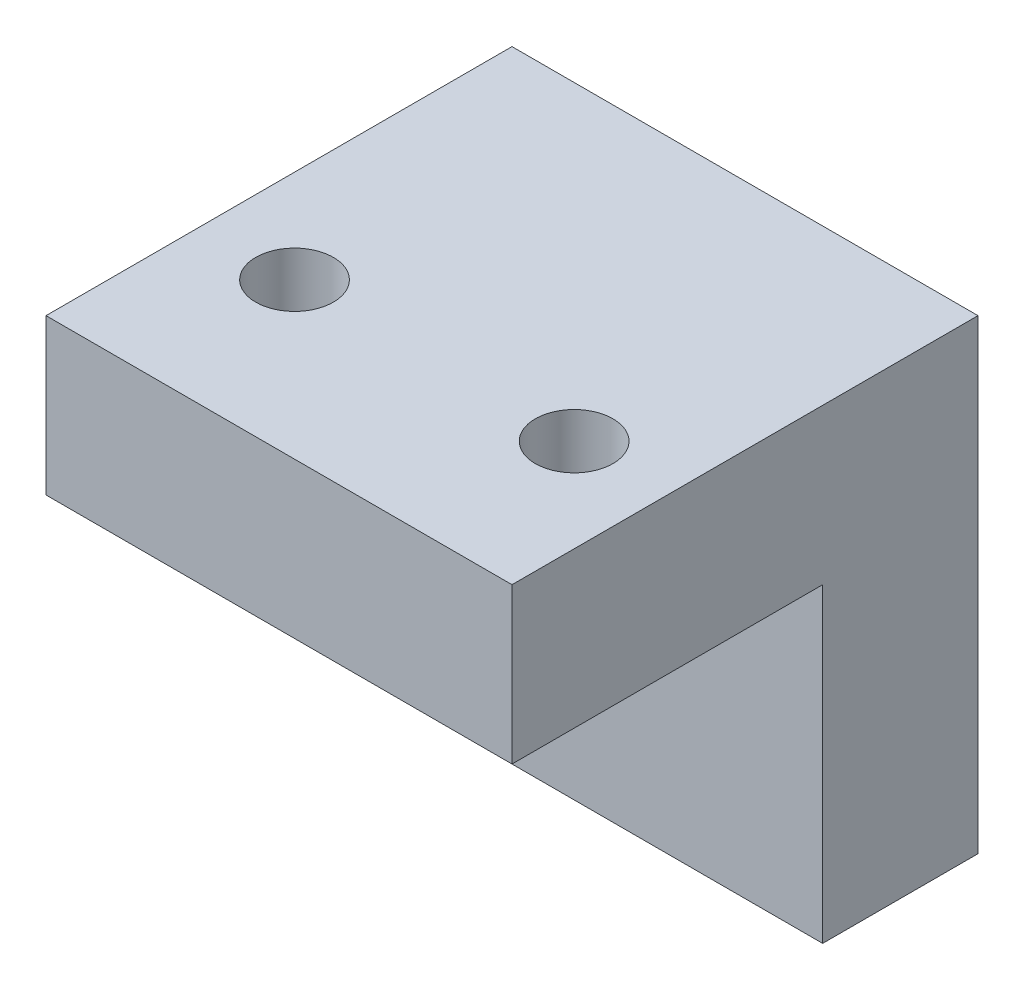
ISO-10303-21;
HEADER;
FILE_DESCRIPTION(('STEP AP214'),'2;1');
FILE_NAME('part.step','',(''),(''),'','','');
FILE_SCHEMA(('AUTOMOTIVE_DESIGN { 1 0 10303 214 1 1 1 1 }'));
ENDSEC;
DATA;
#1=APPLICATION_CONTEXT('core data for automotive mechanical design processes');
#2=APPLICATION_PROTOCOL_DEFINITION('international standard','automotive_design',2000,#1);
#3=PRODUCT_CONTEXT('',#1,'mechanical');
#4=PRODUCT('Part','Part','',(#3));
#5=PRODUCT_RELATED_PRODUCT_CATEGORY('part','',(#4));
#6=PRODUCT_DEFINITION_FORMATION('','',#4);
#7=PRODUCT_DEFINITION_CONTEXT('part definition',#1,'design');
#8=PRODUCT_DEFINITION('design','',#6,#7);
#9=PRODUCT_DEFINITION_SHAPE('','',#8);
#10=(LENGTH_UNIT() NAMED_UNIT(*) SI_UNIT(.MILLI.,.METRE.));
#11=(NAMED_UNIT(*) PLANE_ANGLE_UNIT() SI_UNIT($,.RADIAN.));
#12=(NAMED_UNIT(*) SI_UNIT($,.STERADIAN.) SOLID_ANGLE_UNIT());
#13=UNCERTAINTY_MEASURE_WITH_UNIT(LENGTH_MEASURE(1.E-05),#10,'distance_accuracy_value','');
#14=(GEOMETRIC_REPRESENTATION_CONTEXT(3) GLOBAL_UNCERTAINTY_ASSIGNED_CONTEXT((#13)) GLOBAL_UNIT_ASSIGNED_CONTEXT((#10,
#11,#12)) REPRESENTATION_CONTEXT('',''));
#15=CARTESIAN_POINT('',(0.,0.,0.));
#16=DIRECTION('',(0.,0.,1.));
#17=DIRECTION('',(1.,0.,0.));
#18=AXIS2_PLACEMENT_3D('',#15,#16,#17);
#19=CARTESIAN_POINT('',(0.,10.,0.));
#20=DIRECTION('',(1.,0.,0.));
#21=DIRECTION('',(0.,0.,-1.));
#22=AXIS2_PLACEMENT_3D('',#19,#20,#21);
#23=PLANE('',#22);
#24=DIRECTION('',(0.,0.,1.));
#25=VECTOR('',#24,1.);
#26=CARTESIAN_POINT('',(0.,0.,0.));
#27=LINE('',#26,#25);
#28=CARTESIAN_POINT('',(0.,0.,-5.));
#29=VERTEX_POINT('',#28);
#30=CARTESIAN_POINT('',(0.,0.,0.));
#31=VERTEX_POINT('',#30);
#32=EDGE_CURVE('E93',#29,#31,#27,.T.);
#33=ORIENTED_EDGE('',*,*,#32,.T.);
#34=DIRECTION('',(0.,-1.,0.));
#35=VECTOR('',#34,1.);
#36=CARTESIAN_POINT('',(0.,10.,0.));
#37=LINE('',#36,#35);
#38=CARTESIAN_POINT('',(0.,10.,0.));
#39=VERTEX_POINT('',#38);
#40=EDGE_CURVE('E11',#39,#31,#37,.T.);
#41=ORIENTED_EDGE('',*,*,#40,.F.);
#42=DIRECTION('',(0.,0.,1.));
#43=VECTOR('',#42,1.);
#44=CARTESIAN_POINT('',(0.,10.,-5.));
#45=LINE('',#44,#43);
#46=CARTESIAN_POINT('',(0.,10.,10.));
#47=VERTEX_POINT('',#46);
#48=EDGE_CURVE('E119',#39,#47,#45,.T.);
#49=ORIENTED_EDGE('',*,*,#48,.T.);
#50=DIRECTION('',(0.,-1.,0.));
#51=VECTOR('',#50,1.);
#52=CARTESIAN_POINT('',(0.,15.,10.));
#53=LINE('',#52,#51);
#54=CARTESIAN_POINT('',(0.,15.,10.));
#55=VERTEX_POINT('',#54);
#56=EDGE_CURVE('E113',#55,#47,#53,.T.);
#57=ORIENTED_EDGE('',*,*,#56,.F.);
#58=DIRECTION('',(0.,0.,1.));
#59=VECTOR('',#58,1.);
#60=CARTESIAN_POINT('',(0.,15.,-5.));
#61=LINE('',#60,#59);
#62=CARTESIAN_POINT('',(0.,15.,-5.));
#63=VERTEX_POINT('',#62);
#64=EDGE_CURVE('E103',#63,#55,#61,.T.);
#65=ORIENTED_EDGE('',*,*,#64,.F.);
#66=DIRECTION('',(0.,-1.,0.));
#67=VECTOR('',#66,1.);
#68=CARTESIAN_POINT('',(0.,10.,-5.));
#69=LINE('',#68,#67);
#70=EDGE_CURVE('E88',#63,#29,#69,.T.);
#71=ORIENTED_EDGE('',*,*,#70,.T.);
#72=EDGE_LOOP('',(#33,#41,#49,#57,#65,#71));
#73=FACE_BOUND('',#72,.T.);
#74=ADVANCED_FACE('F36',(#73),#23,.F.);
#75=CARTESIAN_POINT('',(0.,10.,0.));
#76=DIRECTION('',(0.,0.,-1.));
#77=DIRECTION('',(-1.,0.,0.));
#78=AXIS2_PLACEMENT_3D('',#75,#76,#77);
#79=PLANE('',#78);
#80=CARTESIAN_POINT('',(7.5,5.,0.));
#81=DIRECTION('',(0.,0.,1.));
#82=DIRECTION('',(1.,0.,0.));
#83=AXIS2_PLACEMENT_3D('',#80,#81,#82);
#84=CIRCLE('',#83,1.25);
#85=CARTESIAN_POINT('',(8.75,5.,0.));
#86=VERTEX_POINT('',#85);
#87=EDGE_CURVE('E149',#86,#86,#84,.T.);
#88=ORIENTED_EDGE('',*,*,#87,.F.);
#89=EDGE_LOOP('',(#88));
#90=FACE_BOUND('',#89,.T.);
#91=DIRECTION('',(1.,0.,0.));
#92=VECTOR('',#91,1.);
#93=CARTESIAN_POINT('',(0.,0.,0.));
#94=LINE('',#93,#92);
#95=CARTESIAN_POINT('',(15.,0.,0.));
#96=VERTEX_POINT('',#95);
#97=EDGE_CURVE('E79',#31,#96,#94,.T.);
#98=ORIENTED_EDGE('',*,*,#97,.T.);
#99=DIRECTION('',(0.,-1.,0.));
#100=VECTOR('',#99,1.);
#101=CARTESIAN_POINT('',(15.,10.,0.));
#102=LINE('',#101,#100);
#103=CARTESIAN_POINT('',(15.,10.,0.));
#104=VERTEX_POINT('',#103);
#105=EDGE_CURVE('E44',#104,#96,#102,.T.);
#106=ORIENTED_EDGE('',*,*,#105,.F.);
#107=DIRECTION('',(1.,0.,0.));
#108=VECTOR('',#107,1.);
#109=CARTESIAN_POINT('',(0.,10.,0.));
#110=LINE('',#109,#108);
#111=EDGE_CURVE('E50',#39,#104,#110,.T.);
#112=ORIENTED_EDGE('',*,*,#111,.F.);
#113=ORIENTED_EDGE('',*,*,#40,.T.);
#114=EDGE_LOOP('',(#98,#106,#112,#113));
#115=FACE_BOUND('',#114,.T.);
#116=ADVANCED_FACE('F130',(#90,#115),#79,.F.);
#117=CARTESIAN_POINT('',(15.,10.,0.));
#118=DIRECTION('',(-1.,0.,0.));
#119=DIRECTION('',(0.,0.,1.));
#120=AXIS2_PLACEMENT_3D('',#117,#118,#119);
#121=PLANE('',#120);
#122=DIRECTION('',(0.,0.,-1.));
#123=VECTOR('',#122,1.);
#124=CARTESIAN_POINT('',(15.,0.,0.));
#125=LINE('',#124,#123);
#126=CARTESIAN_POINT('',(15.,0.,-5.));
#127=VERTEX_POINT('',#126);
#128=EDGE_CURVE('E68',#96,#127,#125,.T.);
#129=ORIENTED_EDGE('',*,*,#128,.T.);
#130=DIRECTION('',(0.,-1.,0.));
#131=VECTOR('',#130,1.);
#132=CARTESIAN_POINT('',(15.,10.,-5.));
#133=LINE('',#132,#131);
#134=CARTESIAN_POINT('',(15.,15.,-5.));
#135=VERTEX_POINT('',#134);
#136=EDGE_CURVE('E73',#135,#127,#133,.T.);
#137=ORIENTED_EDGE('',*,*,#136,.F.);
#138=DIRECTION('',(0.,0.,-1.));
#139=VECTOR('',#138,1.);
#140=CARTESIAN_POINT('',(15.,15.,-5.));
#141=LINE('',#140,#139);
#142=CARTESIAN_POINT('',(15.,15.,10.));
#143=VERTEX_POINT('',#142);
#144=EDGE_CURVE('E109',#143,#135,#141,.T.);
#145=ORIENTED_EDGE('',*,*,#144,.F.);
#146=DIRECTION('',(0.,-1.,0.));
#147=VECTOR('',#146,1.);
#148=CARTESIAN_POINT('',(15.,15.,10.));
#149=LINE('',#148,#147);
#150=CARTESIAN_POINT('',(15.,10.,10.));
#151=VERTEX_POINT('',#150);
#152=EDGE_CURVE('E110',#143,#151,#149,.T.);
#153=ORIENTED_EDGE('',*,*,#152,.T.);
#154=DIRECTION('',(0.,0.,-1.));
#155=VECTOR('',#154,1.);
#156=CARTESIAN_POINT('',(15.,10.,-5.));
#157=LINE('',#156,#155);
#158=EDGE_CURVE('E126',#151,#104,#157,.T.);
#159=ORIENTED_EDGE('',*,*,#158,.T.);
#160=ORIENTED_EDGE('',*,*,#105,.T.);
#161=EDGE_LOOP('',(#129,#137,#145,#153,#159,#160));
#162=FACE_BOUND('',#161,.T.);
#163=ADVANCED_FACE('F70',(#162),#121,.F.);
#164=CARTESIAN_POINT('',(0.,10.,-5.));
#165=DIRECTION('',(0.,0.,1.));
#166=DIRECTION('',(1.,0.,0.));
#167=AXIS2_PLACEMENT_3D('',#164,#165,#166);
#168=PLANE('',#167);
#169=CARTESIAN_POINT('',(7.5,5.,-5.));
#170=DIRECTION('',(0.,0.,1.));
#171=DIRECTION('',(1.,0.,0.));
#172=AXIS2_PLACEMENT_3D('',#169,#170,#171);
#173=CIRCLE('',#172,1.25);
#174=CARTESIAN_POINT('',(8.75,5.,-5.));
#175=VERTEX_POINT('',#174);
#176=EDGE_CURVE('E123',#175,#175,#173,.T.);
#177=ORIENTED_EDGE('',*,*,#176,.T.);
#178=EDGE_LOOP('',(#177));
#179=FACE_BOUND('',#178,.T.);
#180=DIRECTION('',(-1.,0.,0.));
#181=VECTOR('',#180,1.);
#182=CARTESIAN_POINT('',(0.,0.,-5.));
#183=LINE('',#182,#181);
#184=EDGE_CURVE('E78',#127,#29,#183,.T.);
#185=ORIENTED_EDGE('',*,*,#184,.T.);
#186=ORIENTED_EDGE('',*,*,#70,.F.);
#187=DIRECTION('',(-1.,0.,0.));
#188=VECTOR('',#187,1.);
#189=CARTESIAN_POINT('',(0.,15.,-5.));
#190=LINE('',#189,#188);
#191=EDGE_CURVE('E87',#135,#63,#190,.T.);
#192=ORIENTED_EDGE('',*,*,#191,.F.);
#193=ORIENTED_EDGE('',*,*,#136,.T.);
#194=EDGE_LOOP('',(#185,#186,#192,#193));
#195=FACE_BOUND('',#194,.T.);
#196=ADVANCED_FACE('F83',(#179,#195),#168,.F.);
#197=CARTESIAN_POINT('',(0.,0.,0.));
#198=DIRECTION('',(0.,-1.,0.));
#199=DIRECTION('',(0.,0.,-1.));
#200=AXIS2_PLACEMENT_3D('',#197,#198,#199);
#201=PLANE('',#200);
#202=ORIENTED_EDGE('',*,*,#32,.F.);
#203=ORIENTED_EDGE('',*,*,#184,.F.);
#204=ORIENTED_EDGE('',*,*,#128,.F.);
#205=ORIENTED_EDGE('',*,*,#97,.F.);
#206=EDGE_LOOP('',(#202,#203,#204,#205));
#207=FACE_BOUND('',#206,.T.);
#208=ADVANCED_FACE('F91',(#207),#201,.T.);
#209=CARTESIAN_POINT('',(0.,10.,0.));
#210=DIRECTION('',(0.,1.,0.));
#211=DIRECTION('',(0.,0.,1.));
#212=AXIS2_PLACEMENT_3D('',#209,#210,#211);
#213=PLANE('',#212);
#214=CARTESIAN_POINT('',(3.,10.,5.));
#215=DIRECTION('',(0.,1.,0.));
#216=DIRECTION('',(0.,0.,1.));
#217=AXIS2_PLACEMENT_3D('',#214,#215,#216);
#218=CIRCLE('',#217,1.25);
#219=CARTESIAN_POINT('',(3.,10.,6.25));
#220=VERTEX_POINT('',#219);
#221=EDGE_CURVE('E152',#220,#220,#218,.T.);
#222=ORIENTED_EDGE('',*,*,#221,.T.);
#223=EDGE_LOOP('',(#222));
#224=FACE_BOUND('',#223,.T.);
#225=CARTESIAN_POINT('',(12.,10.,5.));
#226=DIRECTION('',(0.,1.,0.));
#227=DIRECTION('',(0.,0.,1.));
#228=AXIS2_PLACEMENT_3D('',#225,#226,#227);
#229=CIRCLE('',#228,1.25);
#230=CARTESIAN_POINT('',(12.,10.,6.25));
#231=VERTEX_POINT('',#230);
#232=EDGE_CURVE('E158',#231,#231,#229,.T.);
#233=ORIENTED_EDGE('',*,*,#232,.T.);
#234=EDGE_LOOP('',(#233));
#235=FACE_BOUND('',#234,.T.);
#236=ORIENTED_EDGE('',*,*,#48,.F.);
#237=ORIENTED_EDGE('',*,*,#111,.T.);
#238=ORIENTED_EDGE('',*,*,#158,.F.);
#239=DIRECTION('',(1.,0.,0.));
#240=VECTOR('',#239,1.);
#241=CARTESIAN_POINT('',(0.,10.,10.));
#242=LINE('',#241,#240);
#243=EDGE_CURVE('E122',#47,#151,#242,.T.);
#244=ORIENTED_EDGE('',*,*,#243,.F.);
#245=EDGE_LOOP('',(#236,#237,#238,#244));
#246=FACE_BOUND('',#245,.T.);
#247=ADVANCED_FACE('F135',(#224,#235,#246),#213,.F.);
#248=CARTESIAN_POINT('',(0.,15.,10.));
#249=DIRECTION('',(0.,0.,-1.));
#250=DIRECTION('',(-1.,0.,0.));
#251=AXIS2_PLACEMENT_3D('',#248,#249,#250);
#252=PLANE('',#251);
#253=ORIENTED_EDGE('',*,*,#243,.T.);
#254=ORIENTED_EDGE('',*,*,#152,.F.);
#255=DIRECTION('',(1.,0.,0.));
#256=VECTOR('',#255,1.);
#257=CARTESIAN_POINT('',(0.,15.,10.));
#258=LINE('',#257,#256);
#259=EDGE_CURVE('E115',#55,#143,#258,.T.);
#260=ORIENTED_EDGE('',*,*,#259,.F.);
#261=ORIENTED_EDGE('',*,*,#56,.T.);
#262=EDGE_LOOP('',(#253,#254,#260,#261));
#263=FACE_BOUND('',#262,.T.);
#264=ADVANCED_FACE('F142',(#263),#252,.F.);
#265=CARTESIAN_POINT('',(0.,15.,0.));
#266=DIRECTION('',(0.,1.,0.));
#267=DIRECTION('',(0.,0.,1.));
#268=AXIS2_PLACEMENT_3D('',#265,#266,#267);
#269=PLANE('',#268);
#270=CARTESIAN_POINT('',(3.,15.,5.));
#271=DIRECTION('',(0.,1.,0.));
#272=DIRECTION('',(0.,0.,1.));
#273=AXIS2_PLACEMENT_3D('',#270,#271,#272);
#274=CIRCLE('',#273,1.25);
#275=CARTESIAN_POINT('',(3.,15.,6.25));
#276=VERTEX_POINT('',#275);
#277=EDGE_CURVE('E161',#276,#276,#274,.T.);
#278=ORIENTED_EDGE('',*,*,#277,.F.);
#279=EDGE_LOOP('',(#278));
#280=FACE_BOUND('',#279,.T.);
#281=CARTESIAN_POINT('',(12.,15.,5.));
#282=DIRECTION('',(0.,1.,0.));
#283=DIRECTION('',(0.,0.,1.));
#284=AXIS2_PLACEMENT_3D('',#281,#282,#283);
#285=CIRCLE('',#284,1.25);
#286=CARTESIAN_POINT('',(12.,15.,6.25));
#287=VERTEX_POINT('',#286);
#288=EDGE_CURVE('E155',#287,#287,#285,.T.);
#289=ORIENTED_EDGE('',*,*,#288,.F.);
#290=EDGE_LOOP('',(#289));
#291=FACE_BOUND('',#290,.T.);
#292=ORIENTED_EDGE('',*,*,#64,.T.);
#293=ORIENTED_EDGE('',*,*,#259,.T.);
#294=ORIENTED_EDGE('',*,*,#144,.T.);
#295=ORIENTED_EDGE('',*,*,#191,.T.);
#296=EDGE_LOOP('',(#292,#293,#294,#295));
#297=FACE_BOUND('',#296,.T.);
#298=ADVANCED_FACE('F106',(#280,#291,#297),#269,.T.);
#299=CARTESIAN_POINT('',(7.5,5.,-5.));
#300=DIRECTION('',(0.,0.,1.));
#301=DIRECTION('',(1.,0.,0.));
#302=AXIS2_PLACEMENT_3D('',#299,#300,#301);
#303=CYLINDRICAL_SURFACE('',#302,1.25);
#304=ORIENTED_EDGE('',*,*,#176,.F.);
#305=EDGE_LOOP('',(#304));
#306=FACE_BOUND('',#305,.T.);
#307=ORIENTED_EDGE('',*,*,#87,.T.);
#308=EDGE_LOOP('',(#307));
#309=FACE_BOUND('',#308,.T.);
#310=ADVANCED_FACE('F178',(#306,#309),#303,.F.);
#311=CARTESIAN_POINT('',(12.,10.,5.));
#312=DIRECTION('',(0.,1.,0.));
#313=DIRECTION('',(0.,0.,1.));
#314=AXIS2_PLACEMENT_3D('',#311,#312,#313);
#315=CYLINDRICAL_SURFACE('',#314,1.25);
#316=ORIENTED_EDGE('',*,*,#232,.F.);
#317=EDGE_LOOP('',(#316));
#318=FACE_BOUND('',#317,.T.);
#319=ORIENTED_EDGE('',*,*,#288,.T.);
#320=EDGE_LOOP('',(#319));
#321=FACE_BOUND('',#320,.T.);
#322=ADVANCED_FACE('F172',(#318,#321),#315,.F.);
#323=CARTESIAN_POINT('',(3.,10.,5.));
#324=DIRECTION('',(0.,1.,0.));
#325=DIRECTION('',(0.,0.,1.));
#326=AXIS2_PLACEMENT_3D('',#323,#324,#325);
#327=CYLINDRICAL_SURFACE('',#326,1.25);
#328=ORIENTED_EDGE('',*,*,#221,.F.);
#329=EDGE_LOOP('',(#328));
#330=FACE_BOUND('',#329,.T.);
#331=ORIENTED_EDGE('',*,*,#277,.T.);
#332=EDGE_LOOP('',(#331));
#333=FACE_BOUND('',#332,.T.);
#334=ADVANCED_FACE('F169',(#330,#333),#327,.F.);
#335=CLOSED_SHELL('',(#74,#116,#163,#196,#208,#247,#264,#298,#310,#322,#334));
#336=MANIFOLD_SOLID_BREP('B2',#335);
#337=ADVANCED_BREP_SHAPE_REPRESENTATION('',(#18,#336),#14);
#338=SHAPE_DEFINITION_REPRESENTATION(#9,#337);
ENDSEC;
END-ISO-10303-21;
